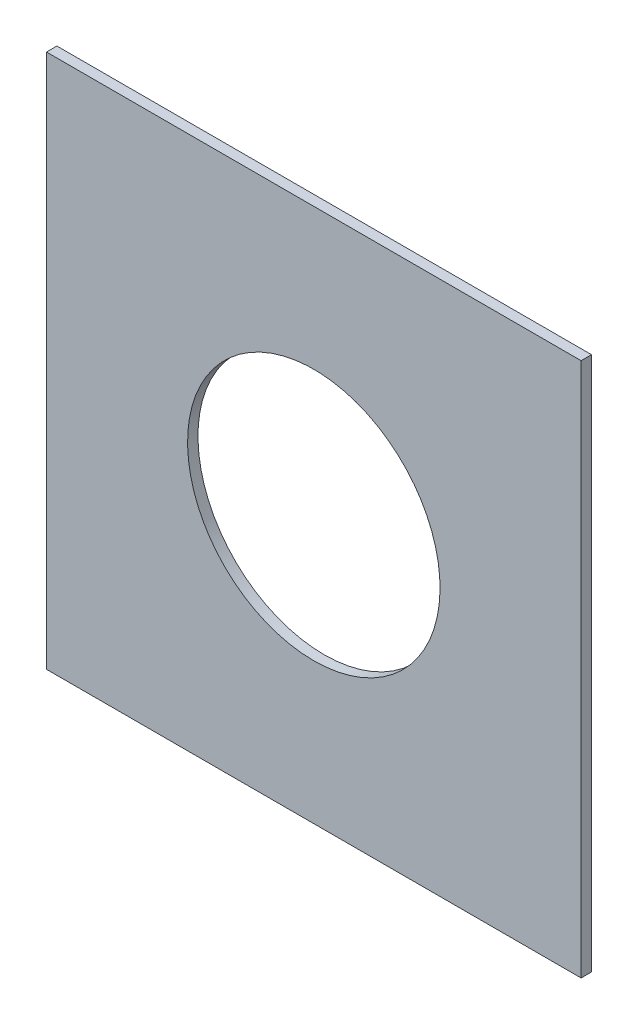
ISO-10303-21;
HEADER;
FILE_DESCRIPTION(('STEP AP214'),'2;1');
FILE_NAME('part.step','',(''),(''),'','','');
FILE_SCHEMA(('AUTOMOTIVE_DESIGN { 1 0 10303 214 1 1 1 1 }'));
ENDSEC;
DATA;
#1=APPLICATION_CONTEXT('core data for automotive mechanical design processes');
#2=APPLICATION_PROTOCOL_DEFINITION('international standard','automotive_design',2000,#1);
#3=PRODUCT_CONTEXT('',#1,'mechanical');
#4=PRODUCT('Part','Part','',(#3));
#5=PRODUCT_RELATED_PRODUCT_CATEGORY('part','',(#4));
#6=PRODUCT_DEFINITION_FORMATION('','',#4);
#7=PRODUCT_DEFINITION_CONTEXT('part definition',#1,'design');
#8=PRODUCT_DEFINITION('design','',#6,#7);
#9=PRODUCT_DEFINITION_SHAPE('','',#8);
#10=(LENGTH_UNIT() NAMED_UNIT(*) SI_UNIT(.MILLI.,.METRE.));
#11=(NAMED_UNIT(*) PLANE_ANGLE_UNIT() SI_UNIT($,.RADIAN.));
#12=(NAMED_UNIT(*) SI_UNIT($,.STERADIAN.) SOLID_ANGLE_UNIT());
#13=UNCERTAINTY_MEASURE_WITH_UNIT(LENGTH_MEASURE(1.E-05),#10,'distance_accuracy_value','');
#14=(GEOMETRIC_REPRESENTATION_CONTEXT(3) GLOBAL_UNCERTAINTY_ASSIGNED_CONTEXT((#13)) GLOBAL_UNIT_ASSIGNED_CONTEXT((#10,
#11,#12)) REPRESENTATION_CONTEXT('',''));
#15=CARTESIAN_POINT('',(0.,0.,0.));
#16=DIRECTION('',(0.,0.,1.));
#17=DIRECTION('',(1.,0.,0.));
#18=AXIS2_PLACEMENT_3D('',#15,#16,#17);
#19=CARTESIAN_POINT('',(169.418,-153.249,-0.045));
#20=DIRECTION('',(0.,0.,-1.));
#21=DIRECTION('',(0.,-1.,0.));
#22=AXIS2_PLACEMENT_3D('',#19,#20,#21);
#23=CYLINDRICAL_SURFACE('',#22,0.425);
#24=CARTESIAN_POINT('',(169.418,-153.249,1.67));
#25=DIRECTION('',(0.,0.,-1.));
#26=DIRECTION('',(0.,-1.,0.));
#27=AXIS2_PLACEMENT_3D('',#24,#25,#26);
#28=CIRCLE('',#27,0.425);
#29=CARTESIAN_POINT('',(169.418,-153.674,1.67));
#30=VERTEX_POINT('',#29);
#31=EDGE_CURVE('E118',#30,#30,#28,.T.);
#32=ORIENTED_EDGE('',*,*,#31,.T.);
#33=DIRECTION('',(0.,0.,1.));
#34=VECTOR('',#33,1.);
#35=CARTESIAN_POINT('',(169.418,-153.674,-0.045));
#36=LINE('',#35,#34);
#37=CARTESIAN_POINT('',(169.418,-153.674,1.705));
#38=VERTEX_POINT('',#37);
#39=EDGE_CURVE('E11',#30,#38,#36,.T.);
#40=ORIENTED_EDGE('',*,*,#39,.T.);
#41=CARTESIAN_POINT('',(169.418,-153.249,1.705));
#42=DIRECTION('',(0.,0.,-1.));
#43=DIRECTION('',(0.,-1.,0.));
#44=AXIS2_PLACEMENT_3D('',#41,#42,#43);
#45=CIRCLE('',#44,0.425);
#46=EDGE_CURVE('E26',#38,#38,#45,.T.);
#47=ORIENTED_EDGE('',*,*,#46,.F.);
#48=ORIENTED_EDGE('',*,*,#39,.F.);
#49=EDGE_LOOP('',(#32,#40,#47,#48));
#50=FACE_BOUND('',#49,.T.);
#51=ADVANCED_FACE('F17',(#50),#23,.F.);
#52=CARTESIAN_POINT('',(168.518,-152.349,1.67));
#53=DIRECTION('',(0.,1.,0.));
#54=DIRECTION('',(1.,0.,0.));
#55=AXIS2_PLACEMENT_3D('',#52,#53,#54);
#56=PLANE('',#55);
#57=DIRECTION('',(0.,0.,1.));
#58=VECTOR('',#57,1.);
#59=CARTESIAN_POINT('',(168.518,-152.349,1.67));
#60=LINE('',#59,#58);
#61=CARTESIAN_POINT('',(168.518,-152.349,1.67));
#62=VERTEX_POINT('',#61);
#63=CARTESIAN_POINT('',(168.518,-152.349,1.705));
#64=VERTEX_POINT('',#63);
#65=EDGE_CURVE('E130',#62,#64,#60,.T.);
#66=ORIENTED_EDGE('',*,*,#65,.T.);
#67=DIRECTION('',(1.,0.,0.));
#68=VECTOR('',#67,1.);
#69=CARTESIAN_POINT('',(168.518,-152.349,1.705));
#70=LINE('',#69,#68);
#71=CARTESIAN_POINT('',(170.318,-152.349,1.705));
#72=VERTEX_POINT('',#71);
#73=EDGE_CURVE('E115',#64,#72,#70,.T.);
#74=ORIENTED_EDGE('',*,*,#73,.T.);
#75=DIRECTION('',(0.,0.,1.));
#76=VECTOR('',#75,1.);
#77=CARTESIAN_POINT('',(170.318,-152.349,1.67));
#78=LINE('',#77,#76);
#79=CARTESIAN_POINT('',(170.318,-152.349,1.67));
#80=VERTEX_POINT('',#79);
#81=EDGE_CURVE('E99',#80,#72,#78,.T.);
#82=ORIENTED_EDGE('',*,*,#81,.F.);
#83=DIRECTION('',(1.,0.,0.));
#84=VECTOR('',#83,1.);
#85=CARTESIAN_POINT('',(168.518,-152.349,1.67));
#86=LINE('',#85,#84);
#87=EDGE_CURVE('E20',#62,#80,#86,.T.);
#88=ORIENTED_EDGE('',*,*,#87,.F.);
#89=EDGE_LOOP('',(#66,#74,#82,#88));
#90=FACE_BOUND('',#89,.T.);
#91=ADVANCED_FACE('F139',(#90),#56,.T.);
#92=CARTESIAN_POINT('',(0.,0.,1.705));
#93=DIRECTION('',(0.,0.,1.));
#94=DIRECTION('',(1.,0.,0.));
#95=AXIS2_PLACEMENT_3D('',#92,#93,#94);
#96=PLANE('',#95);
#97=ORIENTED_EDGE('',*,*,#46,.T.);
#98=EDGE_LOOP('',(#97));
#99=FACE_BOUND('',#98,.T.);
#100=DIRECTION('',(-1.,0.,0.));
#101=VECTOR('',#100,1.);
#102=CARTESIAN_POINT('',(170.318,-154.149,1.705));
#103=LINE('',#102,#101);
#104=CARTESIAN_POINT('',(170.318,-154.149,1.705));
#105=VERTEX_POINT('',#104);
#106=CARTESIAN_POINT('',(168.518,-154.149,1.705));
#107=VERTEX_POINT('',#106);
#108=EDGE_CURVE('E105',#105,#107,#103,.T.);
#109=ORIENTED_EDGE('',*,*,#108,.F.);
#110=DIRECTION('',(0.,-1.,0.));
#111=VECTOR('',#110,1.);
#112=CARTESIAN_POINT('',(170.318,-152.349,1.705));
#113=LINE('',#112,#111);
#114=EDGE_CURVE('E89',#72,#105,#113,.T.);
#115=ORIENTED_EDGE('',*,*,#114,.F.);
#116=ORIENTED_EDGE('',*,*,#73,.F.);
#117=DIRECTION('',(0.,1.,0.));
#118=VECTOR('',#117,1.);
#119=CARTESIAN_POINT('',(168.518,-154.149,1.705));
#120=LINE('',#119,#118);
#121=EDGE_CURVE('E88',#107,#64,#120,.T.);
#122=ORIENTED_EDGE('',*,*,#121,.F.);
#123=EDGE_LOOP('',(#109,#115,#116,#122));
#124=FACE_BOUND('',#123,.T.);
#125=ADVANCED_FACE('F143',(#99,#124),#96,.T.);
#126=CARTESIAN_POINT('',(0.,0.,1.67));
#127=DIRECTION('',(0.,0.,1.));
#128=DIRECTION('',(1.,0.,0.));
#129=AXIS2_PLACEMENT_3D('',#126,#127,#128);
#130=PLANE('',#129);
#131=ORIENTED_EDGE('',*,*,#31,.F.);
#132=EDGE_LOOP('',(#131));
#133=FACE_BOUND('',#132,.T.);
#134=DIRECTION('',(0.,1.,0.));
#135=VECTOR('',#134,1.);
#136=CARTESIAN_POINT('',(168.518,-154.149,1.67));
#137=LINE('',#136,#135);
#138=CARTESIAN_POINT('',(168.518,-154.149,1.67));
#139=VERTEX_POINT('',#138);
#140=EDGE_CURVE('E131',#139,#62,#137,.T.);
#141=ORIENTED_EDGE('',*,*,#140,.T.);
#142=ORIENTED_EDGE('',*,*,#87,.T.);
#143=DIRECTION('',(0.,-1.,0.));
#144=VECTOR('',#143,1.);
#145=CARTESIAN_POINT('',(170.318,-152.349,1.67));
#146=LINE('',#145,#144);
#147=CARTESIAN_POINT('',(170.318,-154.149,1.67));
#148=VERTEX_POINT('',#147);
#149=EDGE_CURVE('E77',#80,#148,#146,.T.);
#150=ORIENTED_EDGE('',*,*,#149,.T.);
#151=DIRECTION('',(-1.,0.,0.));
#152=VECTOR('',#151,1.);
#153=CARTESIAN_POINT('',(170.318,-154.149,1.67));
#154=LINE('',#153,#152);
#155=EDGE_CURVE('E81',#148,#139,#154,.T.);
#156=ORIENTED_EDGE('',*,*,#155,.T.);
#157=EDGE_LOOP('',(#141,#142,#150,#156));
#158=FACE_BOUND('',#157,.T.);
#159=ADVANCED_FACE('F80',(#133,#158),#130,.F.);
#160=CARTESIAN_POINT('',(168.518,-154.149,1.67));
#161=DIRECTION('',(-1.,0.,0.));
#162=DIRECTION('',(0.,0.,1.));
#163=AXIS2_PLACEMENT_3D('',#160,#161,#162);
#164=PLANE('',#163);
#165=DIRECTION('',(0.,0.,1.));
#166=VECTOR('',#165,1.);
#167=CARTESIAN_POINT('',(168.518,-154.149,1.67));
#168=LINE('',#167,#166);
#169=EDGE_CURVE('E97',#139,#107,#168,.T.);
#170=ORIENTED_EDGE('',*,*,#169,.T.);
#171=ORIENTED_EDGE('',*,*,#121,.T.);
#172=ORIENTED_EDGE('',*,*,#65,.F.);
#173=ORIENTED_EDGE('',*,*,#140,.F.);
#174=EDGE_LOOP('',(#170,#171,#172,#173));
#175=FACE_BOUND('',#174,.T.);
#176=ADVANCED_FACE('F141',(#175),#164,.T.);
#177=CARTESIAN_POINT('',(170.318,-152.349,1.67));
#178=DIRECTION('',(1.,0.,0.));
#179=DIRECTION('',(0.,1.,0.));
#180=AXIS2_PLACEMENT_3D('',#177,#178,#179);
#181=PLANE('',#180);
#182=ORIENTED_EDGE('',*,*,#81,.T.);
#183=ORIENTED_EDGE('',*,*,#114,.T.);
#184=DIRECTION('',(0.,0.,1.));
#185=VECTOR('',#184,1.);
#186=CARTESIAN_POINT('',(170.318,-154.149,1.67));
#187=LINE('',#186,#185);
#188=EDGE_CURVE('E95',#148,#105,#187,.T.);
#189=ORIENTED_EDGE('',*,*,#188,.F.);
#190=ORIENTED_EDGE('',*,*,#149,.F.);
#191=EDGE_LOOP('',(#182,#183,#189,#190));
#192=FACE_BOUND('',#191,.T.);
#193=ADVANCED_FACE('F101',(#192),#181,.T.);
#194=CARTESIAN_POINT('',(170.318,-154.149,1.67));
#195=DIRECTION('',(0.,-1.,0.));
#196=DIRECTION('',(0.,0.,-1.));
#197=AXIS2_PLACEMENT_3D('',#194,#195,#196);
#198=PLANE('',#197);
#199=ORIENTED_EDGE('',*,*,#188,.T.);
#200=ORIENTED_EDGE('',*,*,#108,.T.);
#201=ORIENTED_EDGE('',*,*,#169,.F.);
#202=ORIENTED_EDGE('',*,*,#155,.F.);
#203=EDGE_LOOP('',(#199,#200,#201,#202));
#204=FACE_BOUND('',#203,.T.);
#205=ADVANCED_FACE('F93',(#204),#198,.T.);
#206=CLOSED_SHELL('',(#51,#91,#125,#159,#176,#193,#205));
#207=MANIFOLD_SOLID_BREP('B1',#206);
#208=ADVANCED_BREP_SHAPE_REPRESENTATION('',(#18,#207),#14);
#209=SHAPE_DEFINITION_REPRESENTATION(#9,#208);
ENDSEC;
END-ISO-10303-21;
